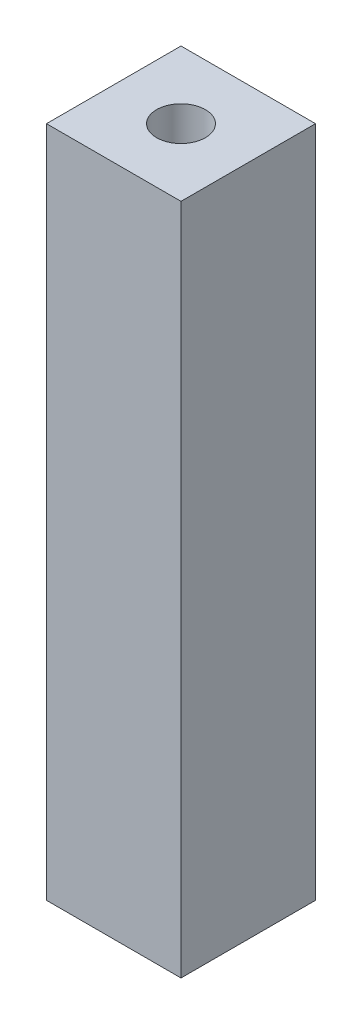
ISO-10303-21;
HEADER;
FILE_DESCRIPTION(('STEP AP214'),'2;1');
FILE_NAME('part.step','',(''),(''),'','','');
FILE_SCHEMA(('AUTOMOTIVE_DESIGN { 1 0 10303 214 1 1 1 1 }'));
ENDSEC;
DATA;
#1=APPLICATION_CONTEXT('core data for automotive mechanical design processes');
#2=APPLICATION_PROTOCOL_DEFINITION('international standard','automotive_design',2000,#1);
#3=PRODUCT_CONTEXT('',#1,'mechanical');
#4=PRODUCT('Part','Part','',(#3));
#5=PRODUCT_RELATED_PRODUCT_CATEGORY('part','',(#4));
#6=PRODUCT_DEFINITION_FORMATION('','',#4);
#7=PRODUCT_DEFINITION_CONTEXT('part definition',#1,'design');
#8=PRODUCT_DEFINITION('design','',#6,#7);
#9=PRODUCT_DEFINITION_SHAPE('','',#8);
#10=(LENGTH_UNIT() NAMED_UNIT(*) SI_UNIT(.MILLI.,.METRE.));
#11=(NAMED_UNIT(*) PLANE_ANGLE_UNIT() SI_UNIT($,.RADIAN.));
#12=(NAMED_UNIT(*) SI_UNIT($,.STERADIAN.) SOLID_ANGLE_UNIT());
#13=UNCERTAINTY_MEASURE_WITH_UNIT(LENGTH_MEASURE(1.E-05),#10,'distance_accuracy_value','');
#14=(GEOMETRIC_REPRESENTATION_CONTEXT(3) GLOBAL_UNCERTAINTY_ASSIGNED_CONTEXT((#13)) GLOBAL_UNIT_ASSIGNED_CONTEXT((#10,
#11,#12)) REPRESENTATION_CONTEXT('',''));
#15=CARTESIAN_POINT('',(0.,0.,0.));
#16=DIRECTION('',(0.,0.,1.));
#17=DIRECTION('',(1.,0.,0.));
#18=AXIS2_PLACEMENT_3D('',#15,#16,#17);
#19=CARTESIAN_POINT('',(4.,40.,4.));
#20=DIRECTION('',(-1.,0.,0.));
#21=DIRECTION('',(0.,0.,1.));
#22=AXIS2_PLACEMENT_3D('',#19,#20,#21);
#23=PLANE('',#22);
#24=DIRECTION('',(0.,0.,-1.));
#25=VECTOR('',#24,1.);
#26=CARTESIAN_POINT('',(4.,0.,4.));
#27=LINE('',#26,#25);
#28=CARTESIAN_POINT('',(4.,0.,4.));
#29=VERTEX_POINT('',#28);
#30=CARTESIAN_POINT('',(4.,0.,-4.));
#31=VERTEX_POINT('',#30);
#32=EDGE_CURVE('E96',#29,#31,#27,.T.);
#33=ORIENTED_EDGE('',*,*,#32,.T.);
#34=DIRECTION('',(0.,-1.,0.));
#35=VECTOR('',#34,1.);
#36=CARTESIAN_POINT('',(4.,40.,-4.));
#37=LINE('',#36,#35);
#38=CARTESIAN_POINT('',(4.,40.,-4.));
#39=VERTEX_POINT('',#38);
#40=EDGE_CURVE('E11',#39,#31,#37,.T.);
#41=ORIENTED_EDGE('',*,*,#40,.F.);
#42=DIRECTION('',(0.,0.,-1.));
#43=VECTOR('',#42,1.);
#44=CARTESIAN_POINT('',(4.,40.,4.));
#45=LINE('',#44,#43);
#46=CARTESIAN_POINT('',(4.,40.,4.));
#47=VERTEX_POINT('',#46);
#48=EDGE_CURVE('E84',#47,#39,#45,.T.);
#49=ORIENTED_EDGE('',*,*,#48,.F.);
#50=DIRECTION('',(0.,-1.,0.));
#51=VECTOR('',#50,1.);
#52=CARTESIAN_POINT('',(4.,40.,4.));
#53=LINE('',#52,#51);
#54=EDGE_CURVE('E92',#47,#29,#53,.T.);
#55=ORIENTED_EDGE('',*,*,#54,.T.);
#56=EDGE_LOOP('',(#33,#41,#49,#55));
#57=FACE_BOUND('',#56,.T.);
#58=ADVANCED_FACE('F33',(#57),#23,.F.);
#59=CARTESIAN_POINT('',(-4.,40.,-4.));
#60=DIRECTION('',(0.,0.,1.));
#61=DIRECTION('',(1.,0.,0.));
#62=AXIS2_PLACEMENT_3D('',#59,#60,#61);
#63=PLANE('',#62);
#64=DIRECTION('',(-1.,0.,0.));
#65=VECTOR('',#64,1.);
#66=CARTESIAN_POINT('',(-4.,0.,-4.));
#67=LINE('',#66,#65);
#68=CARTESIAN_POINT('',(-4.,0.,-4.));
#69=VERTEX_POINT('',#68);
#70=EDGE_CURVE('E88',#31,#69,#67,.T.);
#71=ORIENTED_EDGE('',*,*,#70,.T.);
#72=DIRECTION('',(0.,-1.,0.));
#73=VECTOR('',#72,1.);
#74=CARTESIAN_POINT('',(-4.,40.,-4.));
#75=LINE('',#74,#73);
#76=CARTESIAN_POINT('',(-4.,40.,-4.));
#77=VERTEX_POINT('',#76);
#78=EDGE_CURVE('E41',#77,#69,#75,.T.);
#79=ORIENTED_EDGE('',*,*,#78,.F.);
#80=DIRECTION('',(-1.,0.,0.));
#81=VECTOR('',#80,1.);
#82=CARTESIAN_POINT('',(-4.,40.,-4.));
#83=LINE('',#82,#81);
#84=EDGE_CURVE('E79',#39,#77,#83,.T.);
#85=ORIENTED_EDGE('',*,*,#84,.F.);
#86=ORIENTED_EDGE('',*,*,#40,.T.);
#87=EDGE_LOOP('',(#71,#79,#85,#86));
#88=FACE_BOUND('',#87,.T.);
#89=ADVANCED_FACE('F87',(#88),#63,.F.);
#90=CARTESIAN_POINT('',(-4.,40.,4.));
#91=DIRECTION('',(1.,0.,0.));
#92=DIRECTION('',(0.,0.,-1.));
#93=AXIS2_PLACEMENT_3D('',#90,#91,#92);
#94=PLANE('',#93);
#95=DIRECTION('',(0.,0.,1.));
#96=VECTOR('',#95,1.);
#97=CARTESIAN_POINT('',(-4.,0.,4.));
#98=LINE('',#97,#96);
#99=CARTESIAN_POINT('',(-4.,0.,4.));
#100=VERTEX_POINT('',#99);
#101=EDGE_CURVE('E66',#69,#100,#98,.T.);
#102=ORIENTED_EDGE('',*,*,#101,.T.);
#103=DIRECTION('',(0.,-1.,0.));
#104=VECTOR('',#103,1.);
#105=CARTESIAN_POINT('',(-4.,40.,4.));
#106=LINE('',#105,#104);
#107=CARTESIAN_POINT('',(-4.,40.,4.));
#108=VERTEX_POINT('',#107);
#109=EDGE_CURVE('E89',#108,#100,#106,.T.);
#110=ORIENTED_EDGE('',*,*,#109,.F.);
#111=DIRECTION('',(0.,0.,1.));
#112=VECTOR('',#111,1.);
#113=CARTESIAN_POINT('',(-4.,40.,4.));
#114=LINE('',#113,#112);
#115=EDGE_CURVE('E82',#77,#108,#114,.T.);
#116=ORIENTED_EDGE('',*,*,#115,.F.);
#117=ORIENTED_EDGE('',*,*,#78,.T.);
#118=EDGE_LOOP('',(#102,#110,#116,#117));
#119=FACE_BOUND('',#118,.T.);
#120=ADVANCED_FACE('F90',(#119),#94,.F.);
#121=CARTESIAN_POINT('',(-4.,40.,4.));
#122=DIRECTION('',(0.,0.,-1.));
#123=DIRECTION('',(-1.,0.,0.));
#124=AXIS2_PLACEMENT_3D('',#121,#122,#123);
#125=PLANE('',#124);
#126=DIRECTION('',(1.,0.,0.));
#127=VECTOR('',#126,1.);
#128=CARTESIAN_POINT('',(-4.,0.,4.));
#129=LINE('',#128,#127);
#130=EDGE_CURVE('E72',#100,#29,#129,.T.);
#131=ORIENTED_EDGE('',*,*,#130,.T.);
#132=ORIENTED_EDGE('',*,*,#54,.F.);
#133=DIRECTION('',(1.,0.,0.));
#134=VECTOR('',#133,1.);
#135=CARTESIAN_POINT('',(-4.,40.,4.));
#136=LINE('',#135,#134);
#137=EDGE_CURVE('E49',#108,#47,#136,.T.);
#138=ORIENTED_EDGE('',*,*,#137,.F.);
#139=ORIENTED_EDGE('',*,*,#109,.T.);
#140=EDGE_LOOP('',(#131,#132,#138,#139));
#141=FACE_BOUND('',#140,.T.);
#142=ADVANCED_FACE('F104',(#141),#125,.F.);
#143=CARTESIAN_POINT('',(0.,40.,0.));
#144=DIRECTION('',(0.,-1.,0.));
#145=DIRECTION('',(0.,0.,-1.));
#146=AXIS2_PLACEMENT_3D('',#143,#144,#145);
#147=PLANE('',#146);
#148=CARTESIAN_POINT('',(0.,40.,0.));
#149=DIRECTION('',(0.,1.,0.));
#150=DIRECTION('',(0.,0.,1.));
#151=AXIS2_PLACEMENT_3D('',#148,#149,#150);
#152=CIRCLE('',#151,1.45);
#153=CARTESIAN_POINT('',(0.,40.,1.45));
#154=VERTEX_POINT('',#153);
#155=EDGE_CURVE('E110',#154,#154,#152,.T.);
#156=ORIENTED_EDGE('',*,*,#155,.F.);
#157=EDGE_LOOP('',(#156));
#158=FACE_BOUND('',#157,.T.);
#159=ORIENTED_EDGE('',*,*,#48,.T.);
#160=ORIENTED_EDGE('',*,*,#84,.T.);
#161=ORIENTED_EDGE('',*,*,#115,.T.);
#162=ORIENTED_EDGE('',*,*,#137,.T.);
#163=EDGE_LOOP('',(#159,#160,#161,#162));
#164=FACE_BOUND('',#163,.T.);
#165=ADVANCED_FACE('F80',(#158,#164),#147,.F.);
#166=CARTESIAN_POINT('',(0.,0.,0.));
#167=DIRECTION('',(0.,-1.,0.));
#168=DIRECTION('',(0.,0.,-1.));
#169=AXIS2_PLACEMENT_3D('',#166,#167,#168);
#170=PLANE('',#169);
#171=CARTESIAN_POINT('',(0.,0.,0.));
#172=DIRECTION('',(0.,1.,0.));
#173=DIRECTION('',(0.,0.,1.));
#174=AXIS2_PLACEMENT_3D('',#171,#172,#173);
#175=CIRCLE('',#174,1.45);
#176=CARTESIAN_POINT('',(0.,0.,1.45));
#177=VERTEX_POINT('',#176);
#178=EDGE_CURVE('E99',#177,#177,#175,.T.);
#179=ORIENTED_EDGE('',*,*,#178,.T.);
#180=EDGE_LOOP('',(#179));
#181=FACE_BOUND('',#180,.T.);
#182=ORIENTED_EDGE('',*,*,#32,.F.);
#183=ORIENTED_EDGE('',*,*,#130,.F.);
#184=ORIENTED_EDGE('',*,*,#101,.F.);
#185=ORIENTED_EDGE('',*,*,#70,.F.);
#186=EDGE_LOOP('',(#182,#183,#184,#185));
#187=FACE_BOUND('',#186,.T.);
#188=ADVANCED_FACE('F107',(#181,#187),#170,.T.);
#189=CARTESIAN_POINT('',(0.,0.,0.));
#190=DIRECTION('',(0.,1.,0.));
#191=DIRECTION('',(0.,0.,1.));
#192=AXIS2_PLACEMENT_3D('',#189,#190,#191);
#193=CYLINDRICAL_SURFACE('',#192,1.45);
#194=ORIENTED_EDGE('',*,*,#178,.F.);
#195=EDGE_LOOP('',(#194));
#196=FACE_BOUND('',#195,.T.);
#197=ORIENTED_EDGE('',*,*,#155,.T.);
#198=EDGE_LOOP('',(#197));
#199=FACE_BOUND('',#198,.T.);
#200=ADVANCED_FACE('F117',(#196,#199),#193,.F.);
#201=CLOSED_SHELL('',(#58,#89,#120,#142,#165,#188,#200));
#202=MANIFOLD_SOLID_BREP('B2',#201);
#203=ADVANCED_BREP_SHAPE_REPRESENTATION('',(#18,#202),#14);
#204=SHAPE_DEFINITION_REPRESENTATION(#9,#203);
ENDSEC;
END-ISO-10303-21;
